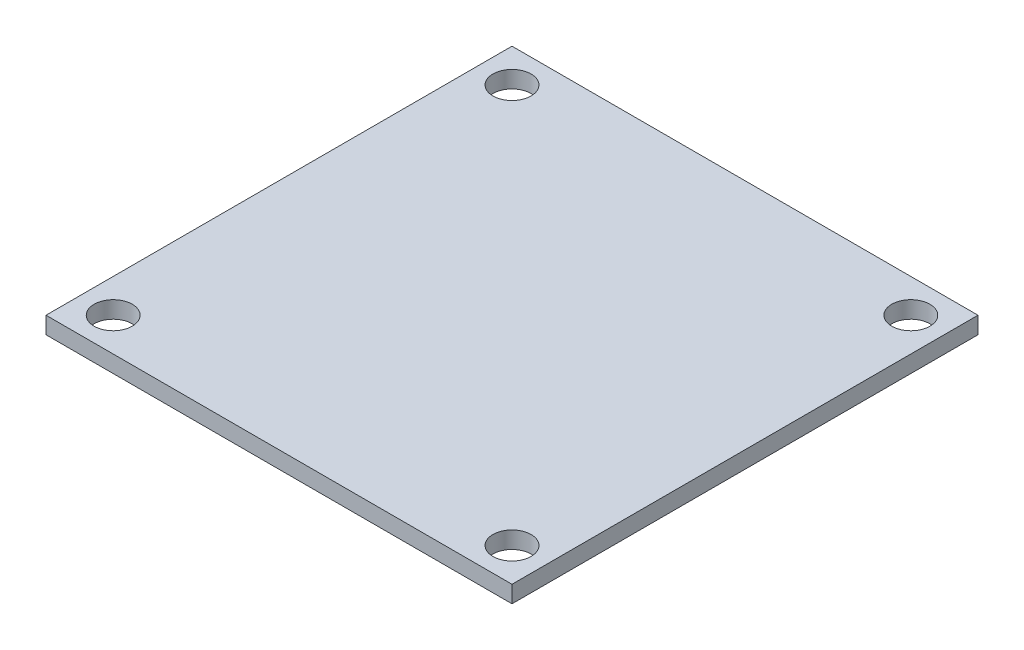
ISO-10303-21;
HEADER;
FILE_DESCRIPTION(('STEP AP214'),'2;1');
FILE_NAME('part.step','',(''),(''),'','','');
FILE_SCHEMA(('AUTOMOTIVE_DESIGN { 1 0 10303 214 1 1 1 1 }'));
ENDSEC;
DATA;
#1=APPLICATION_CONTEXT('core data for automotive mechanical design processes');
#2=APPLICATION_PROTOCOL_DEFINITION('international standard','automotive_design',2000,#1);
#3=PRODUCT_CONTEXT('',#1,'mechanical');
#4=PRODUCT('Part','Part','',(#3));
#5=PRODUCT_RELATED_PRODUCT_CATEGORY('part','',(#4));
#6=PRODUCT_DEFINITION_FORMATION('','',#4);
#7=PRODUCT_DEFINITION_CONTEXT('part definition',#1,'design');
#8=PRODUCT_DEFINITION('design','',#6,#7);
#9=PRODUCT_DEFINITION_SHAPE('','',#8);
#10=(LENGTH_UNIT() NAMED_UNIT(*) SI_UNIT(.MILLI.,.METRE.));
#11=(NAMED_UNIT(*) PLANE_ANGLE_UNIT() SI_UNIT($,.RADIAN.));
#12=(NAMED_UNIT(*) SI_UNIT($,.STERADIAN.) SOLID_ANGLE_UNIT());
#13=UNCERTAINTY_MEASURE_WITH_UNIT(LENGTH_MEASURE(1.E-05),#10,'distance_accuracy_value','');
#14=(GEOMETRIC_REPRESENTATION_CONTEXT(3) GLOBAL_UNCERTAINTY_ASSIGNED_CONTEXT((#13)) GLOBAL_UNIT_ASSIGNED_CONTEXT((#10,
#11,#12)) REPRESENTATION_CONTEXT('',''));
#15=CARTESIAN_POINT('',(0.,0.,0.));
#16=DIRECTION('',(0.,0.,1.));
#17=DIRECTION('',(1.,0.,0.));
#18=AXIS2_PLACEMENT_3D('',#15,#16,#17);
#19=CARTESIAN_POINT('',(-27.5,2.,27.5));
#20=DIRECTION('',(1.,0.,0.));
#21=DIRECTION('',(0.,0.,-1.));
#22=AXIS2_PLACEMENT_3D('',#19,#20,#21);
#23=PLANE('',#22);
#24=DIRECTION('',(0.,0.,1.));
#25=VECTOR('',#24,1.);
#26=CARTESIAN_POINT('',(-27.5,0.,27.5));
#27=LINE('',#26,#25);
#28=CARTESIAN_POINT('',(-27.5,0.,-27.5));
#29=VERTEX_POINT('',#28);
#30=CARTESIAN_POINT('',(-27.5,0.,27.5));
#31=VERTEX_POINT('',#30);
#32=EDGE_CURVE('E107',#29,#31,#27,.T.);
#33=ORIENTED_EDGE('',*,*,#32,.T.);
#34=DIRECTION('',(0.,-1.,0.));
#35=VECTOR('',#34,1.);
#36=CARTESIAN_POINT('',(-27.5,2.,27.5));
#37=LINE('',#36,#35);
#38=CARTESIAN_POINT('',(-27.5,2.,27.5));
#39=VERTEX_POINT('',#38);
#40=EDGE_CURVE('E11',#39,#31,#37,.T.);
#41=ORIENTED_EDGE('',*,*,#40,.F.);
#42=DIRECTION('',(0.,0.,1.));
#43=VECTOR('',#42,1.);
#44=CARTESIAN_POINT('',(-27.5,2.,27.5));
#45=LINE('',#44,#43);
#46=CARTESIAN_POINT('',(-27.5,2.,-27.5));
#47=VERTEX_POINT('',#46);
#48=EDGE_CURVE('E91',#47,#39,#45,.T.);
#49=ORIENTED_EDGE('',*,*,#48,.F.);
#50=DIRECTION('',(0.,-1.,0.));
#51=VECTOR('',#50,1.);
#52=CARTESIAN_POINT('',(-27.5,2.,-27.5));
#53=LINE('',#52,#51);
#54=EDGE_CURVE('E103',#47,#29,#53,.T.);
#55=ORIENTED_EDGE('',*,*,#54,.T.);
#56=EDGE_LOOP('',(#33,#41,#49,#55));
#57=FACE_BOUND('',#56,.T.);
#58=ADVANCED_FACE('F39',(#57),#23,.F.);
#59=CARTESIAN_POINT('',(27.5,2.,27.5));
#60=DIRECTION('',(0.,0.,-1.));
#61=DIRECTION('',(-1.,0.,0.));
#62=AXIS2_PLACEMENT_3D('',#59,#60,#61);
#63=PLANE('',#62);
#64=DIRECTION('',(1.,0.,0.));
#65=VECTOR('',#64,1.);
#66=CARTESIAN_POINT('',(27.5,0.,27.5));
#67=LINE('',#66,#65);
#68=CARTESIAN_POINT('',(27.5,0.,27.5));
#69=VERTEX_POINT('',#68);
#70=EDGE_CURVE('E96',#31,#69,#67,.T.);
#71=ORIENTED_EDGE('',*,*,#70,.T.);
#72=DIRECTION('',(0.,-1.,0.));
#73=VECTOR('',#72,1.);
#74=CARTESIAN_POINT('',(27.5,2.,27.5));
#75=LINE('',#74,#73);
#76=CARTESIAN_POINT('',(27.5,2.,27.5));
#77=VERTEX_POINT('',#76);
#78=EDGE_CURVE('E48',#77,#69,#75,.T.);
#79=ORIENTED_EDGE('',*,*,#78,.F.);
#80=DIRECTION('',(1.,0.,0.));
#81=VECTOR('',#80,1.);
#82=CARTESIAN_POINT('',(27.5,2.,27.5));
#83=LINE('',#82,#81);
#84=EDGE_CURVE('E86',#39,#77,#83,.T.);
#85=ORIENTED_EDGE('',*,*,#84,.F.);
#86=ORIENTED_EDGE('',*,*,#40,.T.);
#87=EDGE_LOOP('',(#71,#79,#85,#86));
#88=FACE_BOUND('',#87,.T.);
#89=ADVANCED_FACE('F95',(#88),#63,.F.);
#90=CARTESIAN_POINT('',(27.5,2.,27.5));
#91=DIRECTION('',(-1.,0.,0.));
#92=DIRECTION('',(0.,0.,1.));
#93=AXIS2_PLACEMENT_3D('',#90,#91,#92);
#94=PLANE('',#93);
#95=DIRECTION('',(0.,0.,-1.));
#96=VECTOR('',#95,1.);
#97=CARTESIAN_POINT('',(27.5,0.,27.5));
#98=LINE('',#97,#96);
#99=CARTESIAN_POINT('',(27.5,0.,-27.5));
#100=VERTEX_POINT('',#99);
#101=EDGE_CURVE('E73',#69,#100,#98,.T.);
#102=ORIENTED_EDGE('',*,*,#101,.T.);
#103=DIRECTION('',(0.,-1.,0.));
#104=VECTOR('',#103,1.);
#105=CARTESIAN_POINT('',(27.5,2.,-27.5));
#106=LINE('',#105,#104);
#107=CARTESIAN_POINT('',(27.5,2.,-27.5));
#108=VERTEX_POINT('',#107);
#109=EDGE_CURVE('E98',#108,#100,#106,.T.);
#110=ORIENTED_EDGE('',*,*,#109,.F.);
#111=DIRECTION('',(0.,0.,-1.));
#112=VECTOR('',#111,1.);
#113=CARTESIAN_POINT('',(27.5,2.,27.5));
#114=LINE('',#113,#112);
#115=EDGE_CURVE('E89',#77,#108,#114,.T.);
#116=ORIENTED_EDGE('',*,*,#115,.F.);
#117=ORIENTED_EDGE('',*,*,#78,.T.);
#118=EDGE_LOOP('',(#102,#110,#116,#117));
#119=FACE_BOUND('',#118,.T.);
#120=ADVANCED_FACE('F99',(#119),#94,.F.);
#121=CARTESIAN_POINT('',(27.5,2.,-27.5));
#122=DIRECTION('',(0.,0.,1.));
#123=DIRECTION('',(1.,0.,0.));
#124=AXIS2_PLACEMENT_3D('',#121,#122,#123);
#125=PLANE('',#124);
#126=DIRECTION('',(-1.,0.,0.));
#127=VECTOR('',#126,1.);
#128=CARTESIAN_POINT('',(27.5,0.,-27.5));
#129=LINE('',#128,#127);
#130=EDGE_CURVE('E79',#100,#29,#129,.T.);
#131=ORIENTED_EDGE('',*,*,#130,.T.);
#132=ORIENTED_EDGE('',*,*,#54,.F.);
#133=DIRECTION('',(-1.,0.,0.));
#134=VECTOR('',#133,1.);
#135=CARTESIAN_POINT('',(27.5,2.,-27.5));
#136=LINE('',#135,#134);
#137=EDGE_CURVE('E56',#108,#47,#136,.T.);
#138=ORIENTED_EDGE('',*,*,#137,.F.);
#139=ORIENTED_EDGE('',*,*,#109,.T.);
#140=EDGE_LOOP('',(#131,#132,#138,#139));
#141=FACE_BOUND('',#140,.T.);
#142=ADVANCED_FACE('F121',(#141),#125,.F.);
#143=CARTESIAN_POINT('',(0.,2.,0.));
#144=DIRECTION('',(0.,1.,0.));
#145=DIRECTION('',(0.,0.,1.));
#146=AXIS2_PLACEMENT_3D('',#143,#144,#145);
#147=PLANE('',#146);
#148=CARTESIAN_POINT('',(-23.5355339059327,2.,23.5355339059327));
#149=DIRECTION('',(0.,1.,0.));
#150=DIRECTION('',(0.,0.,-1.));
#151=AXIS2_PLACEMENT_3D('',#148,#149,#150);
#152=CIRCLE('',#151,2.25);
#153=CARTESIAN_POINT('',(-23.5355339059327,2.,21.2855339059327));
#154=VERTEX_POINT('',#153);
#155=EDGE_CURVE('E145',#154,#154,#152,.T.);
#156=ORIENTED_EDGE('',*,*,#155,.F.);
#157=EDGE_LOOP('',(#156));
#158=FACE_BOUND('',#157,.T.);
#159=CARTESIAN_POINT('',(23.5355339059327,2.,-23.5355339059327));
#160=DIRECTION('',(0.,1.,0.));
#161=DIRECTION('',(0.,0.,-1.));
#162=AXIS2_PLACEMENT_3D('',#159,#160,#161);
#163=CIRCLE('',#162,2.25);
#164=CARTESIAN_POINT('',(23.5355339059327,2.,-25.7855339059327));
#165=VERTEX_POINT('',#164);
#166=EDGE_CURVE('E136',#165,#165,#163,.T.);
#167=ORIENTED_EDGE('',*,*,#166,.F.);
#168=EDGE_LOOP('',(#167));
#169=FACE_BOUND('',#168,.T.);
#170=CARTESIAN_POINT('',(-23.5355339059328,2.,-23.5355339059327));
#171=DIRECTION('',(0.,1.,0.));
#172=DIRECTION('',(0.,0.,1.));
#173=AXIS2_PLACEMENT_3D('',#170,#171,#172);
#174=CIRCLE('',#173,2.25);
#175=CARTESIAN_POINT('',(-23.5355339059328,2.,-21.2855339059327));
#176=VERTEX_POINT('',#175);
#177=EDGE_CURVE('E152',#176,#176,#174,.T.);
#178=ORIENTED_EDGE('',*,*,#177,.F.);
#179=EDGE_LOOP('',(#178));
#180=FACE_BOUND('',#179,.T.);
#181=CARTESIAN_POINT('',(23.5355339059328,2.,23.5355339059327));
#182=DIRECTION('',(0.,1.,0.));
#183=DIRECTION('',(0.,0.,1.));
#184=AXIS2_PLACEMENT_3D('',#181,#182,#183);
#185=CIRCLE('',#184,2.25);
#186=CARTESIAN_POINT('',(23.5355339059328,2.,25.7855339059327));
#187=VERTEX_POINT('',#186);
#188=EDGE_CURVE('E128',#187,#187,#185,.T.);
#189=ORIENTED_EDGE('',*,*,#188,.F.);
#190=EDGE_LOOP('',(#189));
#191=FACE_BOUND('',#190,.T.);
#192=ORIENTED_EDGE('',*,*,#48,.T.);
#193=ORIENTED_EDGE('',*,*,#84,.T.);
#194=ORIENTED_EDGE('',*,*,#115,.T.);
#195=ORIENTED_EDGE('',*,*,#137,.T.);
#196=EDGE_LOOP('',(#192,#193,#194,#195));
#197=FACE_BOUND('',#196,.T.);
#198=ADVANCED_FACE('F87',(#158,#169,#180,#191,#197),#147,.T.);
#199=CARTESIAN_POINT('',(0.,0.,0.));
#200=DIRECTION('',(0.,1.,0.));
#201=DIRECTION('',(0.,0.,1.));
#202=AXIS2_PLACEMENT_3D('',#199,#200,#201);
#203=PLANE('',#202);
#204=CARTESIAN_POINT('',(-23.5355339059327,0.,23.5355339059327));
#205=DIRECTION('',(0.,1.,0.));
#206=DIRECTION('',(0.,0.,-1.));
#207=AXIS2_PLACEMENT_3D('',#204,#205,#206);
#208=CIRCLE('',#207,2.25);
#209=CARTESIAN_POINT('',(-23.5355339059327,0.,21.2855339059327));
#210=VERTEX_POINT('',#209);
#211=EDGE_CURVE('E132',#210,#210,#208,.T.);
#212=ORIENTED_EDGE('',*,*,#211,.T.);
#213=EDGE_LOOP('',(#212));
#214=FACE_BOUND('',#213,.T.);
#215=CARTESIAN_POINT('',(23.5355339059327,0.,-23.5355339059327));
#216=DIRECTION('',(0.,1.,0.));
#217=DIRECTION('',(0.,0.,-1.));
#218=AXIS2_PLACEMENT_3D('',#215,#216,#217);
#219=CIRCLE('',#218,2.25);
#220=CARTESIAN_POINT('',(23.5355339059327,0.,-25.7855339059327));
#221=VERTEX_POINT('',#220);
#222=EDGE_CURVE('E140',#221,#221,#219,.T.);
#223=ORIENTED_EDGE('',*,*,#222,.T.);
#224=EDGE_LOOP('',(#223));
#225=FACE_BOUND('',#224,.T.);
#226=CARTESIAN_POINT('',(-23.5355339059328,0.,-23.5355339059327));
#227=DIRECTION('',(0.,1.,0.));
#228=DIRECTION('',(0.,0.,1.));
#229=AXIS2_PLACEMENT_3D('',#226,#227,#228);
#230=CIRCLE('',#229,2.25);
#231=CARTESIAN_POINT('',(-23.5355339059328,0.,-21.2855339059327));
#232=VERTEX_POINT('',#231);
#233=EDGE_CURVE('E141',#232,#232,#230,.T.);
#234=ORIENTED_EDGE('',*,*,#233,.T.);
#235=EDGE_LOOP('',(#234));
#236=FACE_BOUND('',#235,.T.);
#237=CARTESIAN_POINT('',(23.5355339059328,0.,23.5355339059327));
#238=DIRECTION('',(0.,1.,0.));
#239=DIRECTION('',(0.,0.,1.));
#240=AXIS2_PLACEMENT_3D('',#237,#238,#239);
#241=CIRCLE('',#240,2.25);
#242=CARTESIAN_POINT('',(23.5355339059328,0.,25.7855339059327));
#243=VERTEX_POINT('',#242);
#244=EDGE_CURVE('E111',#243,#243,#241,.T.);
#245=ORIENTED_EDGE('',*,*,#244,.T.);
#246=EDGE_LOOP('',(#245));
#247=FACE_BOUND('',#246,.T.);
#248=ORIENTED_EDGE('',*,*,#32,.F.);
#249=ORIENTED_EDGE('',*,*,#130,.F.);
#250=ORIENTED_EDGE('',*,*,#101,.F.);
#251=ORIENTED_EDGE('',*,*,#70,.F.);
#252=EDGE_LOOP('',(#248,#249,#250,#251));
#253=FACE_BOUND('',#252,.T.);
#254=ADVANCED_FACE('F124',(#214,#225,#236,#247,#253),#203,.F.);
#255=CARTESIAN_POINT('',(23.5355339059328,0.,23.5355339059327));
#256=DIRECTION('',(0.,1.,0.));
#257=DIRECTION('',(0.,0.,1.));
#258=AXIS2_PLACEMENT_3D('',#255,#256,#257);
#259=CYLINDRICAL_SURFACE('',#258,2.25);
#260=ORIENTED_EDGE('',*,*,#244,.F.);
#261=EDGE_LOOP('',(#260));
#262=FACE_BOUND('',#261,.T.);
#263=ORIENTED_EDGE('',*,*,#188,.T.);
#264=EDGE_LOOP('',(#263));
#265=FACE_BOUND('',#264,.T.);
#266=ADVANCED_FACE('F166',(#262,#265),#259,.F.);
#267=CARTESIAN_POINT('',(-23.5355339059328,0.,-23.5355339059327));
#268=DIRECTION('',(0.,1.,0.));
#269=DIRECTION('',(0.,0.,1.));
#270=AXIS2_PLACEMENT_3D('',#267,#268,#269);
#271=CYLINDRICAL_SURFACE('',#270,2.25);
#272=ORIENTED_EDGE('',*,*,#233,.F.);
#273=EDGE_LOOP('',(#272));
#274=FACE_BOUND('',#273,.T.);
#275=ORIENTED_EDGE('',*,*,#177,.T.);
#276=EDGE_LOOP('',(#275));
#277=FACE_BOUND('',#276,.T.);
#278=ADVANCED_FACE('F162',(#274,#277),#271,.F.);
#279=CARTESIAN_POINT('',(23.5355339059327,0.,-23.5355339059327));
#280=DIRECTION('',(0.,1.,0.));
#281=DIRECTION('',(0.,0.,1.));
#282=AXIS2_PLACEMENT_3D('',#279,#280,#281);
#283=CYLINDRICAL_SURFACE('',#282,2.25);
#284=ORIENTED_EDGE('',*,*,#222,.F.);
#285=EDGE_LOOP('',(#284));
#286=FACE_BOUND('',#285,.T.);
#287=ORIENTED_EDGE('',*,*,#166,.T.);
#288=EDGE_LOOP('',(#287));
#289=FACE_BOUND('',#288,.T.);
#290=ADVANCED_FACE('F165',(#286,#289),#283,.F.);
#291=CARTESIAN_POINT('',(-23.5355339059327,0.,23.5355339059327));
#292=DIRECTION('',(0.,1.,0.));
#293=DIRECTION('',(0.,0.,1.));
#294=AXIS2_PLACEMENT_3D('',#291,#292,#293);
#295=CYLINDRICAL_SURFACE('',#294,2.25);
#296=ORIENTED_EDGE('',*,*,#211,.F.);
#297=EDGE_LOOP('',(#296));
#298=FACE_BOUND('',#297,.T.);
#299=ORIENTED_EDGE('',*,*,#155,.T.);
#300=EDGE_LOOP('',(#299));
#301=FACE_BOUND('',#300,.T.);
#302=ADVANCED_FACE('F227',(#298,#301),#295,.F.);
#303=CLOSED_SHELL('',(#58,#89,#120,#142,#198,#254,#266,#278,#290,#302));
#304=MANIFOLD_SOLID_BREP('B2',#303);
#305=ADVANCED_BREP_SHAPE_REPRESENTATION('',(#18,#304),#14);
#306=SHAPE_DEFINITION_REPRESENTATION(#9,#305);
ENDSEC;
END-ISO-10303-21;
